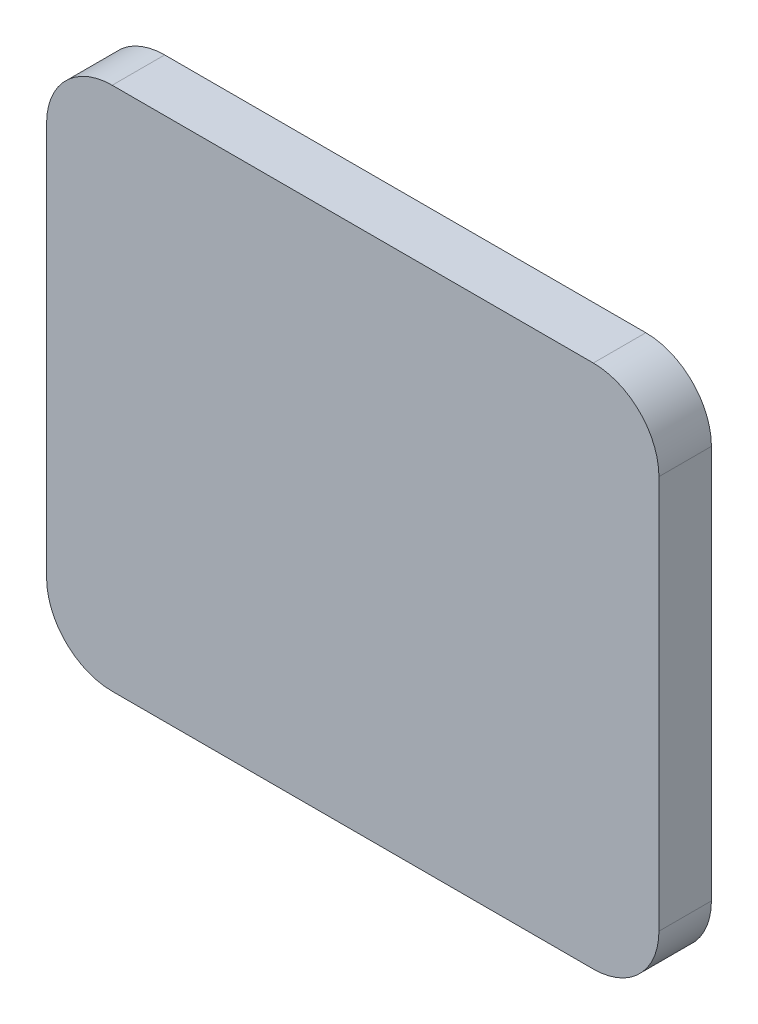
ISO-10303-21;
HEADER;
FILE_DESCRIPTION(('STEP AP214'),'2;1');
FILE_NAME('part.step','',(''),(''),'','','');
FILE_SCHEMA(('AUTOMOTIVE_DESIGN { 1 0 10303 214 1 1 1 1 }'));
ENDSEC;
DATA;
#1=APPLICATION_CONTEXT('core data for automotive mechanical design processes');
#2=APPLICATION_PROTOCOL_DEFINITION('international standard','automotive_design',2000,#1);
#3=PRODUCT_CONTEXT('',#1,'mechanical');
#4=PRODUCT('Part','Part','',(#3));
#5=PRODUCT_RELATED_PRODUCT_CATEGORY('part','',(#4));
#6=PRODUCT_DEFINITION_FORMATION('','',#4);
#7=PRODUCT_DEFINITION_CONTEXT('part definition',#1,'design');
#8=PRODUCT_DEFINITION('design','',#6,#7);
#9=PRODUCT_DEFINITION_SHAPE('','',#8);
#10=(LENGTH_UNIT() NAMED_UNIT(*) SI_UNIT(.MILLI.,.METRE.));
#11=(NAMED_UNIT(*) PLANE_ANGLE_UNIT() SI_UNIT($,.RADIAN.));
#12=(NAMED_UNIT(*) SI_UNIT($,.STERADIAN.) SOLID_ANGLE_UNIT());
#13=UNCERTAINTY_MEASURE_WITH_UNIT(LENGTH_MEASURE(1.E-05),#10,'distance_accuracy_value','');
#14=(GEOMETRIC_REPRESENTATION_CONTEXT(3) GLOBAL_UNCERTAINTY_ASSIGNED_CONTEXT((#13)) GLOBAL_UNIT_ASSIGNED_CONTEXT((#10,
#11,#12)) REPRESENTATION_CONTEXT('',''));
#15=CARTESIAN_POINT('',(0.,0.,0.));
#16=DIRECTION('',(0.,0.,1.));
#17=DIRECTION('',(1.,0.,0.));
#18=AXIS2_PLACEMENT_3D('',#15,#16,#17);
#19=CARTESIAN_POINT('',(-1.1,1.2,0.82));
#20=DIRECTION('',(0.,0.,1.));
#21=DIRECTION('',(1.,0.,0.));
#22=AXIS2_PLACEMENT_3D('',#19,#20,#21);
#23=PLANE('',#22);
#24=CARTESIAN_POINT('',(1.1,-0.9,0.82));
#25=DIRECTION('',(0.,0.,-1.));
#26=DIRECTION('',(-1.,0.,0.));
#27=AXIS2_PLACEMENT_3D('',#24,#25,#26);
#28=CIRCLE('',#27,0.3);
#29=CARTESIAN_POINT('',(1.1,-1.2,0.82));
#30=VERTEX_POINT('',#29);
#31=CARTESIAN_POINT('',(1.4,-0.9,0.82));
#32=VERTEX_POINT('',#31);
#33=EDGE_CURVE('E20',#30,#32,#28,.F.);
#34=ORIENTED_EDGE('',*,*,#33,.F.);
#35=DIRECTION('',(1.,0.,0.));
#36=VECTOR('',#35,1.);
#37=CARTESIAN_POINT('',(1.1,-1.2,0.82));
#38=LINE('',#37,#36);
#39=CARTESIAN_POINT('',(-1.1,-1.2,0.82));
#40=VERTEX_POINT('',#39);
#41=EDGE_CURVE('E100',#40,#30,#38,.T.);
#42=ORIENTED_EDGE('',*,*,#41,.F.);
#43=CARTESIAN_POINT('',(-1.1,-0.9,0.82));
#44=DIRECTION('',(0.,0.,-1.));
#45=DIRECTION('',(-1.,0.,0.));
#46=AXIS2_PLACEMENT_3D('',#43,#44,#45);
#47=CIRCLE('',#46,0.3);
#48=CARTESIAN_POINT('',(-1.4,-0.9,0.82));
#49=VERTEX_POINT('',#48);
#50=EDGE_CURVE('E107',#49,#40,#47,.F.);
#51=ORIENTED_EDGE('',*,*,#50,.F.);
#52=DIRECTION('',(0.,1.,0.));
#53=VECTOR('',#52,1.);
#54=CARTESIAN_POINT('',(-1.4,-0.9,0.82));
#55=LINE('',#54,#53);
#56=CARTESIAN_POINT('',(-1.4,0.9,0.82));
#57=VERTEX_POINT('',#56);
#58=EDGE_CURVE('E111',#57,#49,#55,.F.);
#59=ORIENTED_EDGE('',*,*,#58,.F.);
#60=CARTESIAN_POINT('',(-1.1,0.9,0.82));
#61=DIRECTION('',(0.,0.,-1.));
#62=DIRECTION('',(-1.,0.,0.));
#63=AXIS2_PLACEMENT_3D('',#60,#61,#62);
#64=CIRCLE('',#63,0.3);
#65=CARTESIAN_POINT('',(-1.1,1.2,0.82));
#66=VERTEX_POINT('',#65);
#67=EDGE_CURVE('E115',#66,#57,#64,.F.);
#68=ORIENTED_EDGE('',*,*,#67,.F.);
#69=DIRECTION('',(1.,0.,0.));
#70=VECTOR('',#69,1.);
#71=CARTESIAN_POINT('',(-1.1,1.2,0.82));
#72=LINE('',#71,#70);
#73=CARTESIAN_POINT('',(1.1,1.2,0.82));
#74=VERTEX_POINT('',#73);
#75=EDGE_CURVE('E119',#74,#66,#72,.F.);
#76=ORIENTED_EDGE('',*,*,#75,.F.);
#77=CARTESIAN_POINT('',(1.1,0.9,0.82));
#78=DIRECTION('',(0.,0.,-1.));
#79=DIRECTION('',(-1.,0.,0.));
#80=AXIS2_PLACEMENT_3D('',#77,#78,#79);
#81=CIRCLE('',#80,0.3);
#82=CARTESIAN_POINT('',(1.4,0.9,0.82));
#83=VERTEX_POINT('',#82);
#84=EDGE_CURVE('E89',#83,#74,#81,.F.);
#85=ORIENTED_EDGE('',*,*,#84,.F.);
#86=DIRECTION('',(0.,1.,0.));
#87=VECTOR('',#86,1.);
#88=CARTESIAN_POINT('',(1.4,0.9,0.82));
#89=LINE('',#88,#87);
#90=EDGE_CURVE('E86',#32,#83,#89,.T.);
#91=ORIENTED_EDGE('',*,*,#90,.F.);
#92=EDGE_LOOP('',(#34,#42,#51,#59,#68,#76,#85,#91));
#93=FACE_BOUND('',#92,.T.);
#94=ADVANCED_FACE('F17',(#93),#23,.F.);
#95=CARTESIAN_POINT('',(1.4,0.9,0.82));
#96=DIRECTION('',(1.,0.,0.));
#97=DIRECTION('',(0.,0.,-1.));
#98=AXIS2_PLACEMENT_3D('',#95,#96,#97);
#99=PLANE('',#98);
#100=DIRECTION('',(0.,0.,-1.));
#101=VECTOR('',#100,1.);
#102=CARTESIAN_POINT('',(1.4,0.9,0.82));
#103=LINE('',#102,#101);
#104=CARTESIAN_POINT('',(1.4,0.9,1.059999994636));
#105=VERTEX_POINT('',#104);
#106=EDGE_CURVE('E92',#105,#83,#103,.T.);
#107=ORIENTED_EDGE('',*,*,#106,.F.);
#108=DIRECTION('',(0.,1.,0.));
#109=VECTOR('',#108,1.);
#110=CARTESIAN_POINT('',(1.4,1.2,1.059999994636));
#111=LINE('',#110,#109);
#112=CARTESIAN_POINT('',(1.4,-0.9,1.059999994636));
#113=VERTEX_POINT('',#112);
#114=EDGE_CURVE('E96',#113,#105,#111,.T.);
#115=ORIENTED_EDGE('',*,*,#114,.F.);
#116=DIRECTION('',(0.,0.,-1.));
#117=VECTOR('',#116,1.);
#118=CARTESIAN_POINT('',(1.4,-0.9,0.82));
#119=LINE('',#118,#117);
#120=EDGE_CURVE('E85',#32,#113,#119,.F.);
#121=ORIENTED_EDGE('',*,*,#120,.F.);
#122=ORIENTED_EDGE('',*,*,#90,.T.);
#123=EDGE_LOOP('',(#107,#115,#121,#122));
#124=FACE_BOUND('',#123,.T.);
#125=ADVANCED_FACE('F94',(#124),#99,.T.);
#126=CARTESIAN_POINT('',(1.1,0.9,0.82));
#127=DIRECTION('',(0.,0.,-1.));
#128=DIRECTION('',(-1.,0.,0.));
#129=AXIS2_PLACEMENT_3D('',#126,#127,#128);
#130=CYLINDRICAL_SURFACE('',#129,0.3);
#131=ORIENTED_EDGE('',*,*,#84,.T.);
#132=DIRECTION('',(0.,0.,1.));
#133=VECTOR('',#132,1.);
#134=CARTESIAN_POINT('',(1.1,1.2,0.82));
#135=LINE('',#134,#133);
#136=CARTESIAN_POINT('',(1.1,1.2,1.059999994636));
#137=VERTEX_POINT('',#136);
#138=EDGE_CURVE('E120',#137,#74,#135,.F.);
#139=ORIENTED_EDGE('',*,*,#138,.F.);
#140=CARTESIAN_POINT('',(1.1,0.9,1.059999994636));
#141=DIRECTION('',(0.,0.,-1.));
#142=DIRECTION('',(-1.,0.,0.));
#143=AXIS2_PLACEMENT_3D('',#140,#141,#142);
#144=CIRCLE('',#143,0.3);
#145=EDGE_CURVE('E98',#105,#137,#144,.F.);
#146=ORIENTED_EDGE('',*,*,#145,.F.);
#147=ORIENTED_EDGE('',*,*,#106,.T.);
#148=EDGE_LOOP('',(#131,#139,#146,#147));
#149=FACE_BOUND('',#148,.T.);
#150=ADVANCED_FACE('F139',(#149),#130,.T.);
#151=CARTESIAN_POINT('',(-1.1,1.2,0.82));
#152=DIRECTION('',(0.,1.,0.));
#153=DIRECTION('',(0.,0.,1.));
#154=AXIS2_PLACEMENT_3D('',#151,#152,#153);
#155=PLANE('',#154);
#156=DIRECTION('',(0.,0.,-1.));
#157=VECTOR('',#156,1.);
#158=CARTESIAN_POINT('',(-1.1,1.2,0.82));
#159=LINE('',#158,#157);
#160=CARTESIAN_POINT('',(-1.1,1.2,1.059999994636));
#161=VERTEX_POINT('',#160);
#162=EDGE_CURVE('E116',#161,#66,#159,.T.);
#163=ORIENTED_EDGE('',*,*,#162,.F.);
#164=DIRECTION('',(1.,0.,0.));
#165=VECTOR('',#164,1.);
#166=CARTESIAN_POINT('',(-1.1,1.2,1.059999994636));
#167=LINE('',#166,#165);
#168=EDGE_CURVE('E134',#137,#161,#167,.F.);
#169=ORIENTED_EDGE('',*,*,#168,.F.);
#170=ORIENTED_EDGE('',*,*,#138,.T.);
#171=ORIENTED_EDGE('',*,*,#75,.T.);
#172=EDGE_LOOP('',(#163,#169,#170,#171));
#173=FACE_BOUND('',#172,.T.);
#174=ADVANCED_FACE('F145',(#173),#155,.T.);
#175=CARTESIAN_POINT('',(-1.1,0.9,0.82));
#176=DIRECTION('',(0.,0.,-1.));
#177=DIRECTION('',(-1.,0.,0.));
#178=AXIS2_PLACEMENT_3D('',#175,#176,#177);
#179=CYLINDRICAL_SURFACE('',#178,0.3);
#180=ORIENTED_EDGE('',*,*,#67,.T.);
#181=DIRECTION('',(0.,0.,1.));
#182=VECTOR('',#181,1.);
#183=CARTESIAN_POINT('',(-1.4,0.9,0.82));
#184=LINE('',#183,#182);
#185=CARTESIAN_POINT('',(-1.4,0.9,1.059999994636));
#186=VERTEX_POINT('',#185);
#187=EDGE_CURVE('E112',#186,#57,#184,.F.);
#188=ORIENTED_EDGE('',*,*,#187,.F.);
#189=CARTESIAN_POINT('',(-1.1,0.9,1.059999994636));
#190=DIRECTION('',(0.,0.,-1.));
#191=DIRECTION('',(-1.,0.,0.));
#192=AXIS2_PLACEMENT_3D('',#189,#190,#191);
#193=CIRCLE('',#192,0.3);
#194=EDGE_CURVE('E131',#161,#186,#193,.F.);
#195=ORIENTED_EDGE('',*,*,#194,.F.);
#196=ORIENTED_EDGE('',*,*,#162,.T.);
#197=EDGE_LOOP('',(#180,#188,#195,#196));
#198=FACE_BOUND('',#197,.T.);
#199=ADVANCED_FACE('F203',(#198),#179,.T.);
#200=CARTESIAN_POINT('',(-1.4,-0.9,0.82));
#201=DIRECTION('',(-1.,0.,0.));
#202=DIRECTION('',(0.,0.,1.));
#203=AXIS2_PLACEMENT_3D('',#200,#201,#202);
#204=PLANE('',#203);
#205=DIRECTION('',(0.,0.,-1.));
#206=VECTOR('',#205,1.);
#207=CARTESIAN_POINT('',(-1.4,-0.9,0.82));
#208=LINE('',#207,#206);
#209=CARTESIAN_POINT('',(-1.4,-0.9,1.059999994636));
#210=VERTEX_POINT('',#209);
#211=EDGE_CURVE('E108',#210,#49,#208,.T.);
#212=ORIENTED_EDGE('',*,*,#211,.F.);
#213=DIRECTION('',(0.,1.,0.));
#214=VECTOR('',#213,1.);
#215=CARTESIAN_POINT('',(-1.4,1.2,1.059999994636));
#216=LINE('',#215,#214);
#217=EDGE_CURVE('E130',#186,#210,#216,.F.);
#218=ORIENTED_EDGE('',*,*,#217,.F.);
#219=ORIENTED_EDGE('',*,*,#187,.T.);
#220=ORIENTED_EDGE('',*,*,#58,.T.);
#221=EDGE_LOOP('',(#212,#218,#219,#220));
#222=FACE_BOUND('',#221,.T.);
#223=ADVANCED_FACE('F157',(#222),#204,.T.);
#224=CARTESIAN_POINT('',(-1.1,-0.9,0.82));
#225=DIRECTION('',(0.,0.,-1.));
#226=DIRECTION('',(-1.,0.,0.));
#227=AXIS2_PLACEMENT_3D('',#224,#225,#226);
#228=CYLINDRICAL_SURFACE('',#227,0.3);
#229=ORIENTED_EDGE('',*,*,#50,.T.);
#230=DIRECTION('',(0.,0.,-1.));
#231=VECTOR('',#230,1.);
#232=CARTESIAN_POINT('',(-1.1,-1.2,0.82));
#233=LINE('',#232,#231);
#234=CARTESIAN_POINT('',(-1.1,-1.2,1.059999994636));
#235=VERTEX_POINT('',#234);
#236=EDGE_CURVE('E104',#235,#40,#233,.T.);
#237=ORIENTED_EDGE('',*,*,#236,.F.);
#238=CARTESIAN_POINT('',(-1.1,-0.9,1.059999994636));
#239=DIRECTION('',(0.,0.,-1.));
#240=DIRECTION('',(-1.,0.,0.));
#241=AXIS2_PLACEMENT_3D('',#238,#239,#240);
#242=CIRCLE('',#241,0.3);
#243=EDGE_CURVE('E127',#210,#235,#242,.F.);
#244=ORIENTED_EDGE('',*,*,#243,.F.);
#245=ORIENTED_EDGE('',*,*,#211,.T.);
#246=EDGE_LOOP('',(#229,#237,#244,#245));
#247=FACE_BOUND('',#246,.T.);
#248=ADVANCED_FACE('F160',(#247),#228,.T.);
#249=CARTESIAN_POINT('',(1.1,-1.2,0.82));
#250=DIRECTION('',(0.,-1.,0.));
#251=DIRECTION('',(0.,0.,-1.));
#252=AXIS2_PLACEMENT_3D('',#249,#250,#251);
#253=PLANE('',#252);
#254=DIRECTION('',(0.,0.,-1.));
#255=VECTOR('',#254,1.);
#256=CARTESIAN_POINT('',(1.1,-1.2,0.82));
#257=LINE('',#256,#255);
#258=CARTESIAN_POINT('',(1.1,-1.2,1.059999994636));
#259=VERTEX_POINT('',#258);
#260=EDGE_CURVE('E35',#259,#30,#257,.T.);
#261=ORIENTED_EDGE('',*,*,#260,.F.);
#262=DIRECTION('',(1.,0.,0.));
#263=VECTOR('',#262,1.);
#264=CARTESIAN_POINT('',(-1.1,-1.2,1.059999994636));
#265=LINE('',#264,#263);
#266=EDGE_CURVE('E26',#235,#259,#265,.T.);
#267=ORIENTED_EDGE('',*,*,#266,.F.);
#268=ORIENTED_EDGE('',*,*,#236,.T.);
#269=ORIENTED_EDGE('',*,*,#41,.T.);
#270=EDGE_LOOP('',(#261,#267,#268,#269));
#271=FACE_BOUND('',#270,.T.);
#272=ADVANCED_FACE('F161',(#271),#253,.T.);
#273=CARTESIAN_POINT('',(1.1,-0.9,0.82));
#274=DIRECTION('',(0.,0.,-1.));
#275=DIRECTION('',(-1.,0.,0.));
#276=AXIS2_PLACEMENT_3D('',#273,#274,#275);
#277=CYLINDRICAL_SURFACE('',#276,0.3);
#278=ORIENTED_EDGE('',*,*,#33,.T.);
#279=ORIENTED_EDGE('',*,*,#120,.T.);
#280=CARTESIAN_POINT('',(1.1,-0.9,1.059999994636));
#281=DIRECTION('',(0.,0.,-1.));
#282=DIRECTION('',(-1.,0.,0.));
#283=AXIS2_PLACEMENT_3D('',#280,#281,#282);
#284=CIRCLE('',#283,0.3);
#285=EDGE_CURVE('E11',#259,#113,#284,.F.);
#286=ORIENTED_EDGE('',*,*,#285,.F.);
#287=ORIENTED_EDGE('',*,*,#260,.T.);
#288=EDGE_LOOP('',(#278,#279,#286,#287));
#289=FACE_BOUND('',#288,.T.);
#290=ADVANCED_FACE('F83',(#289),#277,.T.);
#291=CARTESIAN_POINT('',(-1.1,1.2,1.059999994636));
#292=DIRECTION('',(0.,0.,1.));
#293=DIRECTION('',(1.,0.,0.));
#294=AXIS2_PLACEMENT_3D('',#291,#292,#293);
#295=PLANE('',#294);
#296=ORIENTED_EDGE('',*,*,#266,.T.);
#297=ORIENTED_EDGE('',*,*,#285,.T.);
#298=ORIENTED_EDGE('',*,*,#114,.T.);
#299=ORIENTED_EDGE('',*,*,#145,.T.);
#300=ORIENTED_EDGE('',*,*,#168,.T.);
#301=ORIENTED_EDGE('',*,*,#194,.T.);
#302=ORIENTED_EDGE('',*,*,#217,.T.);
#303=ORIENTED_EDGE('',*,*,#243,.T.);
#304=EDGE_LOOP('',(#296,#297,#298,#299,#300,#301,#302,#303));
#305=FACE_BOUND('',#304,.T.);
#306=ADVANCED_FACE('F150',(#305),#295,.T.);
#307=CLOSED_SHELL('',(#94,#125,#150,#174,#199,#223,#248,#272,#290,#306));
#308=MANIFOLD_SOLID_BREP('B1',#307);
#309=ADVANCED_BREP_SHAPE_REPRESENTATION('',(#18,#308),#14);
#310=SHAPE_DEFINITION_REPRESENTATION(#9,#309);
ENDSEC;
END-ISO-10303-21;
